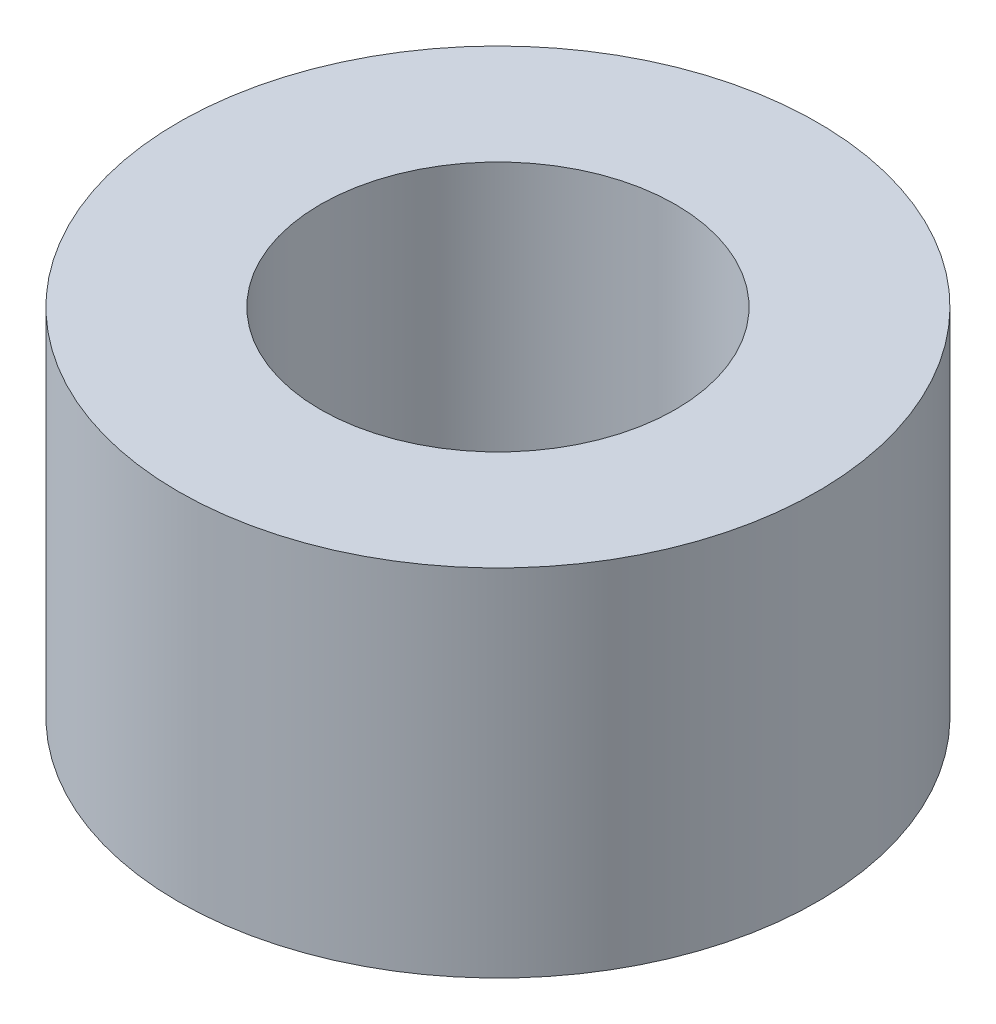
ISO-10303-21;
HEADER;
FILE_DESCRIPTION(('STEP AP214'),'2;1');
FILE_NAME('part.step','',(''),(''),'','','');
FILE_SCHEMA(('AUTOMOTIVE_DESIGN { 1 0 10303 214 1 1 1 1 }'));
ENDSEC;
DATA;
#1=APPLICATION_CONTEXT('core data for automotive mechanical design processes');
#2=APPLICATION_PROTOCOL_DEFINITION('international standard','automotive_design',2000,#1);
#3=PRODUCT_CONTEXT('',#1,'mechanical');
#4=PRODUCT('Part','Part','',(#3));
#5=PRODUCT_RELATED_PRODUCT_CATEGORY('part','',(#4));
#6=PRODUCT_DEFINITION_FORMATION('','',#4);
#7=PRODUCT_DEFINITION_CONTEXT('part definition',#1,'design');
#8=PRODUCT_DEFINITION('design','',#6,#7);
#9=PRODUCT_DEFINITION_SHAPE('','',#8);
#10=(LENGTH_UNIT() NAMED_UNIT(*) SI_UNIT(.MILLI.,.METRE.));
#11=(NAMED_UNIT(*) PLANE_ANGLE_UNIT() SI_UNIT($,.RADIAN.));
#12=(NAMED_UNIT(*) SI_UNIT($,.STERADIAN.) SOLID_ANGLE_UNIT());
#13=UNCERTAINTY_MEASURE_WITH_UNIT(LENGTH_MEASURE(1.E-05),#10,'distance_accuracy_value','');
#14=(GEOMETRIC_REPRESENTATION_CONTEXT(3) GLOBAL_UNCERTAINTY_ASSIGNED_CONTEXT((#13)) GLOBAL_UNIT_ASSIGNED_CONTEXT((#10,
#11,#12)) REPRESENTATION_CONTEXT('',''));
#15=CARTESIAN_POINT('',(0.,0.,0.));
#16=DIRECTION('',(0.,0.,1.));
#17=DIRECTION('',(1.,0.,0.));
#18=AXIS2_PLACEMENT_3D('',#15,#16,#17);
#19=CARTESIAN_POINT('',(0.,2.5,0.));
#20=DIRECTION('',(0.,1.,0.));
#21=DIRECTION('',(0.,0.,1.));
#22=AXIS2_PLACEMENT_3D('',#19,#20,#21);
#23=PLANE('',#22);
#24=CARTESIAN_POINT('',(0.,2.5,0.));
#25=DIRECTION('',(0.,1.,0.));
#26=DIRECTION('',(0.,0.,1.));
#27=AXIS2_PLACEMENT_3D('',#24,#25,#26);
#28=CIRCLE('',#27,2.25);
#29=CARTESIAN_POINT('',(0.,2.5,2.25));
#30=VERTEX_POINT('',#29);
#31=EDGE_CURVE('E10',#30,#30,#28,.T.);
#32=ORIENTED_EDGE('',*,*,#31,.T.);
#33=EDGE_LOOP('',(#32));
#34=FACE_BOUND('',#33,.T.);
#35=CARTESIAN_POINT('',(0.,2.5,0.));
#36=DIRECTION('',(0.,1.,0.));
#37=DIRECTION('',(0.,0.,1.));
#38=AXIS2_PLACEMENT_3D('',#35,#36,#37);
#39=CIRCLE('',#38,1.25);
#40=CARTESIAN_POINT('',(0.,2.5,1.25));
#41=VERTEX_POINT('',#40);
#42=EDGE_CURVE('E42',#41,#41,#39,.T.);
#43=ORIENTED_EDGE('',*,*,#42,.F.);
#44=EDGE_LOOP('',(#43));
#45=FACE_BOUND('',#44,.T.);
#46=ADVANCED_FACE('F31',(#34,#45),#23,.T.);
#47=CARTESIAN_POINT('',(0.,0.,0.));
#48=DIRECTION('',(0.,1.,0.));
#49=DIRECTION('',(0.,0.,1.));
#50=AXIS2_PLACEMENT_3D('',#47,#48,#49);
#51=PLANE('',#50);
#52=CARTESIAN_POINT('',(0.,0.,0.));
#53=DIRECTION('',(0.,1.,0.));
#54=DIRECTION('',(0.,0.,1.));
#55=AXIS2_PLACEMENT_3D('',#52,#53,#54);
#56=CIRCLE('',#55,2.25);
#57=CARTESIAN_POINT('',(0.,0.,2.25));
#58=VERTEX_POINT('',#57);
#59=EDGE_CURVE('E35',#58,#58,#56,.T.);
#60=ORIENTED_EDGE('',*,*,#59,.F.);
#61=EDGE_LOOP('',(#60));
#62=FACE_BOUND('',#61,.T.);
#63=CARTESIAN_POINT('',(0.,0.,0.));
#64=DIRECTION('',(0.,1.,0.));
#65=DIRECTION('',(0.,0.,1.));
#66=AXIS2_PLACEMENT_3D('',#63,#64,#65);
#67=CIRCLE('',#66,1.25);
#68=CARTESIAN_POINT('',(0.,0.,1.25));
#69=VERTEX_POINT('',#68);
#70=EDGE_CURVE('E44',#69,#69,#67,.T.);
#71=ORIENTED_EDGE('',*,*,#70,.T.);
#72=EDGE_LOOP('',(#71));
#73=FACE_BOUND('',#72,.T.);
#74=ADVANCED_FACE('F54',(#62,#73),#51,.F.);
#75=CARTESIAN_POINT('',(0.,2.5,0.));
#76=DIRECTION('',(0.,-1.,0.));
#77=DIRECTION('',(0.,0.,-1.));
#78=AXIS2_PLACEMENT_3D('',#75,#76,#77);
#79=CYLINDRICAL_SURFACE('',#78,2.25);
#80=ORIENTED_EDGE('',*,*,#31,.F.);
#81=EDGE_LOOP('',(#80));
#82=FACE_BOUND('',#81,.T.);
#83=ORIENTED_EDGE('',*,*,#59,.T.);
#84=EDGE_LOOP('',(#83));
#85=FACE_BOUND('',#84,.T.);
#86=ADVANCED_FACE('F33',(#82,#85),#79,.T.);
#87=CARTESIAN_POINT('',(0.,2.5,0.));
#88=DIRECTION('',(0.,-1.,0.));
#89=DIRECTION('',(0.,0.,-1.));
#90=AXIS2_PLACEMENT_3D('',#87,#88,#89);
#91=CYLINDRICAL_SURFACE('',#90,1.25);
#92=ORIENTED_EDGE('',*,*,#42,.T.);
#93=EDGE_LOOP('',(#92));
#94=FACE_BOUND('',#93,.T.);
#95=ORIENTED_EDGE('',*,*,#70,.F.);
#96=EDGE_LOOP('',(#95));
#97=FACE_BOUND('',#96,.T.);
#98=ADVANCED_FACE('F50',(#94,#97),#91,.F.);
#99=CLOSED_SHELL('',(#46,#74,#86,#98));
#100=MANIFOLD_SOLID_BREP('B2',#99);
#101=ADVANCED_BREP_SHAPE_REPRESENTATION('',(#18,#100),#14);
#102=SHAPE_DEFINITION_REPRESENTATION(#9,#101);
ENDSEC;
END-ISO-10303-21;
